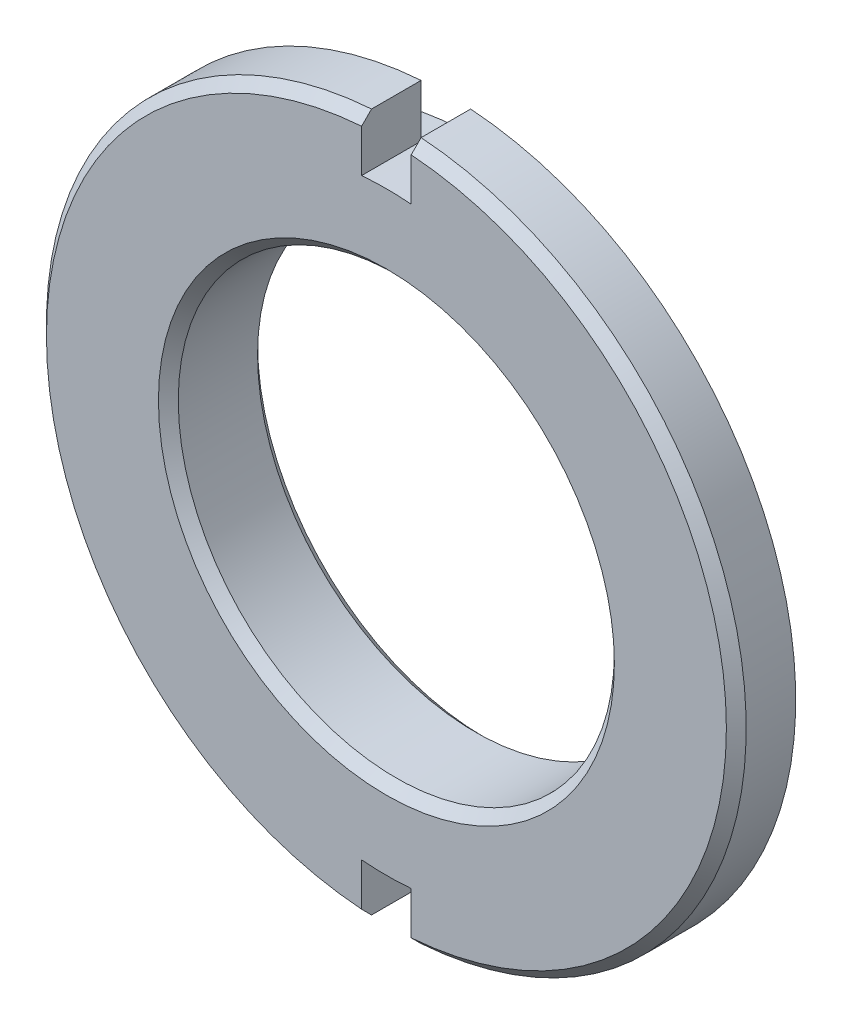
ISO-10303-21;
HEADER;
FILE_DESCRIPTION(('STEP AP214'),'2;1');
FILE_NAME('part.step','',(''),(''),'','','');
FILE_SCHEMA(('AUTOMOTIVE_DESIGN { 1 0 10303 214 1 1 1 1 }'));
ENDSEC;
DATA;
#1=APPLICATION_CONTEXT('core data for automotive mechanical design processes');
#2=APPLICATION_PROTOCOL_DEFINITION('international standard','automotive_design',2000,#1);
#3=PRODUCT_CONTEXT('',#1,'mechanical');
#4=PRODUCT('Part','Part','',(#3));
#5=PRODUCT_RELATED_PRODUCT_CATEGORY('part','',(#4));
#6=PRODUCT_DEFINITION_FORMATION('','',#4);
#7=PRODUCT_DEFINITION_CONTEXT('part definition',#1,'design');
#8=PRODUCT_DEFINITION('design','',#6,#7);
#9=PRODUCT_DEFINITION_SHAPE('','',#8);
#10=(LENGTH_UNIT() NAMED_UNIT(*) SI_UNIT(.MILLI.,.METRE.));
#11=(NAMED_UNIT(*) PLANE_ANGLE_UNIT() SI_UNIT($,.RADIAN.));
#12=(NAMED_UNIT(*) SI_UNIT($,.STERADIAN.) SOLID_ANGLE_UNIT());
#13=UNCERTAINTY_MEASURE_WITH_UNIT(LENGTH_MEASURE(1.E-05),#10,'distance_accuracy_value','');
#14=(GEOMETRIC_REPRESENTATION_CONTEXT(3) GLOBAL_UNCERTAINTY_ASSIGNED_CONTEXT((#13)) GLOBAL_UNIT_ASSIGNED_CONTEXT((#10,
#11,#12)) REPRESENTATION_CONTEXT('',''));
#15=CARTESIAN_POINT('',(0.,0.,0.));
#16=DIRECTION('',(0.,0.,1.));
#17=DIRECTION('',(1.,0.,0.));
#18=AXIS2_PLACEMENT_3D('',#15,#16,#17);
#19=CARTESIAN_POINT('',(0.,0.,0.));
#20=DIRECTION('',(0.,0.,1.));
#21=DIRECTION('',(-1.,0.,0.));
#22=AXIS2_PLACEMENT_3D('',#19,#20,#21);
#23=CONICAL_SURFACE('',#22,11.5,0.785398163397447);
#24=CARTESIAN_POINT('',(0.,0.,-0.5));
#25=DIRECTION('',(0.,0.,-1.));
#26=DIRECTION('',(1.,0.,0.));
#27=AXIS2_PLACEMENT_3D('',#24,#25,#26);
#28=CIRCLE('',#27,11.);
#29=CARTESIAN_POINT('',(11.,0.,-0.5));
#30=VERTEX_POINT('',#29);
#31=EDGE_CURVE('E154',#30,#30,#28,.T.);
#32=ORIENTED_EDGE('',*,*,#31,.T.);
#33=DIRECTION('',(0.707106781186546,0.,0.707106781186549));
#34=VECTOR('',#33,1.);
#35=CARTESIAN_POINT('',(11.5,0.,0.));
#36=LINE('',#35,#34);
#37=CARTESIAN_POINT('',(11.5,0.,0.));
#38=VERTEX_POINT('',#37);
#39=EDGE_CURVE('E11',#30,#38,#36,.T.);
#40=ORIENTED_EDGE('',*,*,#39,.T.);
#41=CARTESIAN_POINT('',(0.,0.,0.));
#42=DIRECTION('',(0.,0.,1.));
#43=DIRECTION('',(1.,0.,0.));
#44=AXIS2_PLACEMENT_3D('',#41,#42,#43);
#45=CIRCLE('',#44,11.5);
#46=EDGE_CURVE('E156',#38,#38,#45,.T.);
#47=ORIENTED_EDGE('',*,*,#46,.T.);
#48=ORIENTED_EDGE('',*,*,#39,.F.);
#49=EDGE_LOOP('',(#32,#40,#47,#48));
#50=FACE_BOUND('',#49,.T.);
#51=ADVANCED_FACE('F16',(#50),#23,.F.);
#52=CARTESIAN_POINT('',(0.,0.,-0.5));
#53=DIRECTION('',(0.,0.,-1.));
#54=DIRECTION('',(-1.,0.,0.));
#55=AXIS2_PLACEMENT_3D('',#52,#53,#54);
#56=CONICAL_SURFACE('',#55,17.65,0.785398163397448);
#57=CARTESIAN_POINT('',(-1.25,17.1043854025802,0.));
#58=CARTESIAN_POINT('',(-1.25,17.3514318912049,-0.246389408384427));
#59=CARTESIAN_POINT('',(-1.25,17.6056809013458,-0.500000000000395));
#60=(BOUNDED_CURVE() B_SPLINE_CURVE(2,(#57,#58,#59),.UNSPECIFIED.,.F.,
.F.) B_SPLINE_CURVE_WITH_KNOTS((3,3),(-0.550361411524432,-0.474870831724073),
.UNSPECIFIED.) CURVE() GEOMETRIC_REPRESENTATION_ITEM() RATIONAL_B_SPLINE_CURVE((1.00316637598992,
1.00370777140882,1.00404107196294)) REPRESENTATION_ITEM(''));
#61=CARTESIAN_POINT('',(-1.25,17.1043854025802,0.));
#62=VERTEX_POINT('',#61);
#63=CARTESIAN_POINT('',(-1.25,17.6056809013455,-0.5));
#64=VERTEX_POINT('',#63);
#65=EDGE_CURVE('E223',#62,#64,#60,.T.);
#66=ORIENTED_EDGE('',*,*,#65,.T.);
#67=CARTESIAN_POINT('',(0.,0.,-0.5));
#68=DIRECTION('',(0.,0.,1.));
#69=DIRECTION('',(1.,0.,0.));
#70=AXIS2_PLACEMENT_3D('',#67,#68,#69);
#71=CIRCLE('',#70,17.65);
#72=CARTESIAN_POINT('',(-1.25,-17.6056809013455,-0.5));
#73=VERTEX_POINT('',#72);
#74=EDGE_CURVE('E208',#64,#73,#71,.T.);
#75=ORIENTED_EDGE('',*,*,#74,.T.);
#76=CARTESIAN_POINT('',(-1.25,-17.6056809013458,-0.500000000000396));
#77=CARTESIAN_POINT('',(-1.25,-17.3514318912049,-0.246389408384428));
#78=CARTESIAN_POINT('',(-1.25,-17.1043854025802,0.));
#79=(BOUNDED_CURVE() B_SPLINE_CURVE(2,(#76,#77,#78),.UNSPECIFIED.,.F.,
.F.) B_SPLINE_CURVE_WITH_KNOTS((3,3),(-0.233047929422891,-0.157557349622532),
.UNSPECIFIED.) CURVE() GEOMETRIC_REPRESENTATION_ITEM() RATIONAL_B_SPLINE_CURVE((1.00404107196294,
1.00370777140882,1.00316637598992)) REPRESENTATION_ITEM(''));
#80=CARTESIAN_POINT('',(-1.25,-17.1043854025802,0.));
#81=VERTEX_POINT('',#80);
#82=EDGE_CURVE('E257',#73,#81,#79,.T.);
#83=ORIENTED_EDGE('',*,*,#82,.T.);
#84=CARTESIAN_POINT('',(0.,0.,0.));
#85=DIRECTION('',(0.,0.,-1.));
#86=DIRECTION('',(1.,0.,0.));
#87=AXIS2_PLACEMENT_3D('',#84,#85,#86);
#88=CIRCLE('',#87,17.15);
#89=EDGE_CURVE('E181',#81,#62,#88,.T.);
#90=ORIENTED_EDGE('',*,*,#89,.T.);
#91=EDGE_LOOP('',(#66,#75,#83,#90));
#92=FACE_BOUND('',#91,.T.);
#93=ADVANCED_FACE('F334',(#92),#56,.T.);
#94=CARTESIAN_POINT('',(0.,0.,-0.5));
#95=DIRECTION('',(0.,0.,-1.));
#96=DIRECTION('',(1.,0.,0.));
#97=AXIS2_PLACEMENT_3D('',#94,#95,#96);
#98=CONICAL_SURFACE('',#97,17.65,0.785398163397448);
#99=CARTESIAN_POINT('',(1.25,-17.1043854025802,0.));
#100=CARTESIAN_POINT('',(1.25,-17.3514318912049,-0.246389408384427));
#101=CARTESIAN_POINT('',(1.25,-17.6056809013458,-0.500000000000395));
#102=(BOUNDED_CURVE() B_SPLINE_CURVE(2,(#99,#100,#101),.UNSPECIFIED.,.F.,
.F.) B_SPLINE_CURVE_WITH_KNOTS((3,3),(-0.550361411524432,-0.474870831724073),
.UNSPECIFIED.) CURVE() GEOMETRIC_REPRESENTATION_ITEM() RATIONAL_B_SPLINE_CURVE((1.00316637598992,
1.00370777140882,1.00404107196294)) REPRESENTATION_ITEM(''));
#103=CARTESIAN_POINT('',(1.25,-17.1043854025802,0.));
#104=VERTEX_POINT('',#103);
#105=CARTESIAN_POINT('',(1.25,-17.6056809013455,-0.5));
#106=VERTEX_POINT('',#105);
#107=EDGE_CURVE('E248',#104,#106,#102,.T.);
#108=ORIENTED_EDGE('',*,*,#107,.T.);
#109=CARTESIAN_POINT('',(0.,0.,-0.5));
#110=DIRECTION('',(0.,0.,1.));
#111=DIRECTION('',(1.,0.,0.));
#112=AXIS2_PLACEMENT_3D('',#109,#110,#111);
#113=CIRCLE('',#112,17.65);
#114=CARTESIAN_POINT('',(1.25,17.6056809013455,-0.5));
#115=VERTEX_POINT('',#114);
#116=EDGE_CURVE('E310',#106,#115,#113,.T.);
#117=ORIENTED_EDGE('',*,*,#116,.T.);
#118=CARTESIAN_POINT('',(1.25,17.6056809013458,-0.500000000000396));
#119=CARTESIAN_POINT('',(1.25,17.3514318912049,-0.246389408384428));
#120=CARTESIAN_POINT('',(1.25,17.1043854025802,0.));
#121=(BOUNDED_CURVE() B_SPLINE_CURVE(2,(#118,#119,#120),.UNSPECIFIED.,.F.,
.F.) B_SPLINE_CURVE_WITH_KNOTS((3,3),(-0.233047929422891,-0.157557349622532),
.UNSPECIFIED.) CURVE() GEOMETRIC_REPRESENTATION_ITEM() RATIONAL_B_SPLINE_CURVE((1.00404107196294,
1.00370777140882,1.00316637598992)) REPRESENTATION_ITEM(''));
#122=CARTESIAN_POINT('',(1.25,17.1043854025802,0.));
#123=VERTEX_POINT('',#122);
#124=EDGE_CURVE('E228',#115,#123,#121,.T.);
#125=ORIENTED_EDGE('',*,*,#124,.T.);
#126=CARTESIAN_POINT('',(0.,0.,0.));
#127=DIRECTION('',(0.,0.,-1.));
#128=DIRECTION('',(1.,0.,0.));
#129=AXIS2_PLACEMENT_3D('',#126,#127,#128);
#130=CIRCLE('',#129,17.15);
#131=EDGE_CURVE('E160',#123,#104,#130,.T.);
#132=ORIENTED_EDGE('',*,*,#131,.T.);
#133=EDGE_LOOP('',(#108,#117,#125,#132));
#134=FACE_BOUND('',#133,.T.);
#135=ADVANCED_FACE('F364',(#134),#98,.T.);
#136=CARTESIAN_POINT('',(0.,0.,-5.));
#137=DIRECTION('',(0.,0.,1.));
#138=DIRECTION('',(-1.,0.,0.));
#139=AXIS2_PLACEMENT_3D('',#136,#137,#138);
#140=CONICAL_SURFACE('',#139,14.5,0.785398163397448);
#141=CARTESIAN_POINT('',(0.,0.,-4.5));
#142=DIRECTION('',(0.,0.,-1.));
#143=DIRECTION('',(1.,0.,0.));
#144=AXIS2_PLACEMENT_3D('',#141,#142,#143);
#145=CIRCLE('',#144,15.);
#146=CARTESIAN_POINT('',(15.,0.,-4.5));
#147=VERTEX_POINT('',#146);
#148=CARTESIAN_POINT('',(-15.,0.,-4.5));
#149=VERTEX_POINT('',#148);
#150=EDGE_CURVE('E216',#147,#149,#145,.T.);
#151=ORIENTED_EDGE('',*,*,#150,.T.);
#152=CARTESIAN_POINT('',(0.,0.,-4.5));
#153=DIRECTION('',(0.,0.,-1.));
#154=DIRECTION('',(1.,0.,0.));
#155=AXIS2_PLACEMENT_3D('',#152,#153,#154);
#156=CIRCLE('',#155,15.);
#157=EDGE_CURVE('E212',#149,#147,#156,.T.);
#158=ORIENTED_EDGE('',*,*,#157,.T.);
#159=DIRECTION('',(-0.707106781186548,0.,-0.707106781186548));
#160=VECTOR('',#159,1.);
#161=CARTESIAN_POINT('',(14.5,0.,-5.));
#162=LINE('',#161,#160);
#163=CARTESIAN_POINT('',(14.5,0.,-5.));
#164=VERTEX_POINT('',#163);
#165=EDGE_CURVE('E27',#147,#164,#162,.T.);
#166=ORIENTED_EDGE('',*,*,#165,.T.);
#167=CARTESIAN_POINT('',(0.,0.,-5.));
#168=DIRECTION('',(0.,0.,1.));
#169=DIRECTION('',(1.,0.,0.));
#170=AXIS2_PLACEMENT_3D('',#167,#168,#169);
#171=CIRCLE('',#170,14.5);
#172=EDGE_CURVE('E296',#164,#164,#171,.T.);
#173=ORIENTED_EDGE('',*,*,#172,.T.);
#174=ORIENTED_EDGE('',*,*,#165,.F.);
#175=EDGE_LOOP('',(#151,#158,#166,#173,#174));
#176=FACE_BOUND('',#175,.T.);
#177=ADVANCED_FACE('F563',(#176),#140,.T.);
#178=CARTESIAN_POINT('',(0.,0.,-4.5));
#179=DIRECTION('',(0.,0.,-1.));
#180=DIRECTION('',(1.,0.,0.));
#181=AXIS2_PLACEMENT_3D('',#178,#179,#180);
#182=CONICAL_SURFACE('',#181,11.,0.785398163397447);
#183=CARTESIAN_POINT('',(0.,0.,-4.5));
#184=DIRECTION('',(0.,0.,1.));
#185=DIRECTION('',(1.,0.,0.));
#186=AXIS2_PLACEMENT_3D('',#183,#184,#185);
#187=CIRCLE('',#186,11.);
#188=CARTESIAN_POINT('',(11.,0.,-4.5));
#189=VERTEX_POINT('',#188);
#190=CARTESIAN_POINT('',(-11.,0.,-4.5));
#191=VERTEX_POINT('',#190);
#192=EDGE_CURVE('E159',#189,#191,#187,.T.);
#193=ORIENTED_EDGE('',*,*,#192,.T.);
#194=DIRECTION('',(-0.707106781186546,0.,-0.707106781186549));
#195=VECTOR('',#194,1.);
#196=CARTESIAN_POINT('',(-11.,0.,-4.5));
#197=LINE('',#196,#195);
#198=CARTESIAN_POINT('',(-11.5,0.,-5.));
#199=VERTEX_POINT('',#198);
#200=EDGE_CURVE('E235',#191,#199,#197,.T.);
#201=ORIENTED_EDGE('',*,*,#200,.T.);
#202=CARTESIAN_POINT('',(0.,0.,-5.));
#203=DIRECTION('',(0.,0.,-1.));
#204=DIRECTION('',(1.,0.,0.));
#205=AXIS2_PLACEMENT_3D('',#202,#203,#204);
#206=CIRCLE('',#205,11.5);
#207=CARTESIAN_POINT('',(11.5,0.,-5.));
#208=VERTEX_POINT('',#207);
#209=EDGE_CURVE('E203',#199,#208,#206,.T.);
#210=ORIENTED_EDGE('',*,*,#209,.T.);
#211=CARTESIAN_POINT('',(0.,0.,-5.));
#212=DIRECTION('',(0.,0.,-1.));
#213=DIRECTION('',(1.,0.,0.));
#214=AXIS2_PLACEMENT_3D('',#211,#212,#213);
#215=CIRCLE('',#214,11.5);
#216=EDGE_CURVE('E222',#208,#199,#215,.T.);
#217=ORIENTED_EDGE('',*,*,#216,.T.);
#218=ORIENTED_EDGE('',*,*,#200,.F.);
#219=CARTESIAN_POINT('',(0.,0.,-4.5));
#220=DIRECTION('',(0.,0.,1.));
#221=DIRECTION('',(1.,0.,0.));
#222=AXIS2_PLACEMENT_3D('',#219,#220,#221);
#223=CIRCLE('',#222,11.);
#224=EDGE_CURVE('E188',#191,#189,#223,.T.);
#225=ORIENTED_EDGE('',*,*,#224,.T.);
#226=EDGE_LOOP('',(#193,#201,#210,#217,#218,#225));
#227=FACE_BOUND('',#226,.T.);
#228=ADVANCED_FACE('F541',(#227),#182,.F.);
#229=CARTESIAN_POINT('',(-1.25,-14.9478259288767,0.00100000000000013));
#230=DIRECTION('',(1.,0.,0.));
#231=DIRECTION('',(0.,1.,0.));
#232=AXIS2_PLACEMENT_3D('',#229,#230,#231);
#233=PLANE('',#232);
#234=DIRECTION('',(0.,0.,-1.));
#235=VECTOR('',#234,1.);
#236=CARTESIAN_POINT('',(-1.25,-17.6056809013455,-0.5));
#237=LINE('',#236,#235);
#238=CARTESIAN_POINT('',(-1.25,-17.6056809013455,-3.));
#239=VERTEX_POINT('',#238);
#240=EDGE_CURVE('E204',#73,#239,#237,.T.);
#241=ORIENTED_EDGE('',*,*,#240,.T.);
#242=DIRECTION('',(0.,-1.,0.));
#243=VECTOR('',#242,1.);
#244=CARTESIAN_POINT('',(-1.25,-14.9478259288767,-3.));
#245=LINE('',#244,#243);
#246=CARTESIAN_POINT('',(-1.25,-14.9478259288767,-3.));
#247=VERTEX_POINT('',#246);
#248=EDGE_CURVE('E191',#247,#239,#245,.T.);
#249=ORIENTED_EDGE('',*,*,#248,.F.);
#250=DIRECTION('',(0.,0.,-1.));
#251=VECTOR('',#250,1.);
#252=CARTESIAN_POINT('',(-1.25,-14.9478259288767,0.));
#253=LINE('',#252,#251);
#254=CARTESIAN_POINT('',(-1.25,-14.9478259288767,0.));
#255=VERTEX_POINT('',#254);
#256=EDGE_CURVE('E229',#255,#247,#253,.T.);
#257=ORIENTED_EDGE('',*,*,#256,.F.);
#258=DIRECTION('',(0.,1.,0.));
#259=VECTOR('',#258,1.);
#260=CARTESIAN_POINT('',(-1.25,-17.1043854025802,0.));
#261=LINE('',#260,#259);
#262=EDGE_CURVE('E176',#81,#255,#261,.T.);
#263=ORIENTED_EDGE('',*,*,#262,.F.);
#264=ORIENTED_EDGE('',*,*,#82,.F.);
#265=EDGE_LOOP('',(#241,#249,#257,#263,#264));
#266=FACE_BOUND('',#265,.T.);
#267=ADVANCED_FACE('F352',(#266),#233,.T.);
#268=CARTESIAN_POINT('',(1.25,-14.9478259288767,0.00100000000000013));
#269=DIRECTION('',(-1.,0.,0.));
#270=DIRECTION('',(0.,0.,1.));
#271=AXIS2_PLACEMENT_3D('',#268,#269,#270);
#272=PLANE('',#271);
#273=DIRECTION('',(0.,-1.,0.));
#274=VECTOR('',#273,1.);
#275=CARTESIAN_POINT('',(1.25,-14.9478259288767,0.));
#276=LINE('',#275,#274);
#277=CARTESIAN_POINT('',(1.25,-14.9478259288767,0.));
#278=VERTEX_POINT('',#277);
#279=EDGE_CURVE('E171',#278,#104,#276,.T.);
#280=ORIENTED_EDGE('',*,*,#279,.F.);
#281=DIRECTION('',(0.,0.,-1.));
#282=VECTOR('',#281,1.);
#283=CARTESIAN_POINT('',(1.25,-14.9478259288767,0.));
#284=LINE('',#283,#282);
#285=CARTESIAN_POINT('',(1.25,-14.9478259288767,-3.));
#286=VERTEX_POINT('',#285);
#287=EDGE_CURVE('E238',#278,#286,#284,.T.);
#288=ORIENTED_EDGE('',*,*,#287,.T.);
#289=DIRECTION('',(0.,1.,0.));
#290=VECTOR('',#289,1.);
#291=CARTESIAN_POINT('',(1.25,-17.6056809013455,-3.));
#292=LINE('',#291,#290);
#293=CARTESIAN_POINT('',(1.25,-17.6056809013455,-3.));
#294=VERTEX_POINT('',#293);
#295=EDGE_CURVE('E197',#294,#286,#292,.T.);
#296=ORIENTED_EDGE('',*,*,#295,.F.);
#297=DIRECTION('',(0.,0.,-1.));
#298=VECTOR('',#297,1.);
#299=CARTESIAN_POINT('',(1.25,-17.6056809013455,-0.5));
#300=LINE('',#299,#298);
#301=EDGE_CURVE('E285',#106,#294,#300,.T.);
#302=ORIENTED_EDGE('',*,*,#301,.F.);
#303=ORIENTED_EDGE('',*,*,#107,.F.);
#304=EDGE_LOOP('',(#280,#288,#296,#302,#303));
#305=FACE_BOUND('',#304,.T.);
#306=ADVANCED_FACE('F360',(#305),#272,.T.);
#307=CARTESIAN_POINT('',(1.25,17.6056809013455,0.00100000000000013));
#308=DIRECTION('',(-1.,0.,0.));
#309=DIRECTION('',(0.,0.,1.));
#310=AXIS2_PLACEMENT_3D('',#307,#308,#309);
#311=PLANE('',#310);
#312=DIRECTION('',(0.,0.,-1.));
#313=VECTOR('',#312,1.);
#314=CARTESIAN_POINT('',(1.25,17.6056809013455,-0.5));
#315=LINE('',#314,#313);
#316=CARTESIAN_POINT('',(1.25,17.6056809013455,-3.));
#317=VERTEX_POINT('',#316);
#318=EDGE_CURVE('E284',#115,#317,#315,.T.);
#319=ORIENTED_EDGE('',*,*,#318,.T.);
#320=DIRECTION('',(0.,1.,0.));
#321=VECTOR('',#320,1.);
#322=CARTESIAN_POINT('',(1.25,14.9478259288767,-3.));
#323=LINE('',#322,#321);
#324=CARTESIAN_POINT('',(1.25,14.9478259288767,-3.));
#325=VERTEX_POINT('',#324);
#326=EDGE_CURVE('E196',#325,#317,#323,.T.);
#327=ORIENTED_EDGE('',*,*,#326,.F.);
#328=DIRECTION('',(0.,0.,-1.));
#329=VECTOR('',#328,1.);
#330=CARTESIAN_POINT('',(1.25,14.9478259288767,0.));
#331=LINE('',#330,#329);
#332=CARTESIAN_POINT('',(1.25,14.9478259288767,0.));
#333=VERTEX_POINT('',#332);
#334=EDGE_CURVE('E241',#333,#325,#331,.T.);
#335=ORIENTED_EDGE('',*,*,#334,.F.);
#336=DIRECTION('',(0.,-1.,0.));
#337=VECTOR('',#336,1.);
#338=CARTESIAN_POINT('',(1.25,17.1043854025802,0.));
#339=LINE('',#338,#337);
#340=EDGE_CURVE('E175',#123,#333,#339,.T.);
#341=ORIENTED_EDGE('',*,*,#340,.F.);
#342=ORIENTED_EDGE('',*,*,#124,.F.);
#343=EDGE_LOOP('',(#319,#327,#335,#341,#342));
#344=FACE_BOUND('',#343,.T.);
#345=ADVANCED_FACE('F368',(#344),#311,.T.);
#346=CARTESIAN_POINT('',(-1.25,17.6056809013455,0.00100000000000013));
#347=DIRECTION('',(1.,0.,0.));
#348=DIRECTION('',(0.,1.,0.));
#349=AXIS2_PLACEMENT_3D('',#346,#347,#348);
#350=PLANE('',#349);
#351=DIRECTION('',(0.,1.,0.));
#352=VECTOR('',#351,1.);
#353=CARTESIAN_POINT('',(-1.25,14.9478259288767,0.));
#354=LINE('',#353,#352);
#355=CARTESIAN_POINT('',(-1.25,14.9478259288767,0.));
#356=VERTEX_POINT('',#355);
#357=EDGE_CURVE('E269',#356,#62,#354,.T.);
#358=ORIENTED_EDGE('',*,*,#357,.F.);
#359=DIRECTION('',(0.,0.,-1.));
#360=VECTOR('',#359,1.);
#361=CARTESIAN_POINT('',(-1.25,14.9478259288767,0.));
#362=LINE('',#361,#360);
#363=CARTESIAN_POINT('',(-1.25,14.9478259288767,-3.));
#364=VERTEX_POINT('',#363);
#365=EDGE_CURVE('E20',#356,#364,#362,.T.);
#366=ORIENTED_EDGE('',*,*,#365,.T.);
#367=DIRECTION('',(0.,-1.,0.));
#368=VECTOR('',#367,1.);
#369=CARTESIAN_POINT('',(-1.25,17.6056809013455,-3.));
#370=LINE('',#369,#368);
#371=CARTESIAN_POINT('',(-1.25,17.6056809013455,-3.));
#372=VERTEX_POINT('',#371);
#373=EDGE_CURVE('E187',#372,#364,#370,.T.);
#374=ORIENTED_EDGE('',*,*,#373,.F.);
#375=DIRECTION('',(0.,0.,-1.));
#376=VECTOR('',#375,1.);
#377=CARTESIAN_POINT('',(-1.25,17.6056809013455,-0.5));
#378=LINE('',#377,#376);
#379=EDGE_CURVE('E198',#64,#372,#378,.T.);
#380=ORIENTED_EDGE('',*,*,#379,.F.);
#381=ORIENTED_EDGE('',*,*,#65,.F.);
#382=EDGE_LOOP('',(#358,#366,#374,#380,#381));
#383=FACE_BOUND('',#382,.T.);
#384=ADVANCED_FACE('F343',(#383),#350,.T.);
#385=CARTESIAN_POINT('',(0.,0.,-3.));
#386=DIRECTION('',(0.,0.,1.));
#387=DIRECTION('',(1.,0.,0.));
#388=AXIS2_PLACEMENT_3D('',#385,#386,#387);
#389=CYLINDRICAL_SURFACE('',#388,15.);
#390=ORIENTED_EDGE('',*,*,#150,.F.);
#391=ORIENTED_EDGE('',*,*,#157,.F.);
#392=DIRECTION('',(0.,0.,1.));
#393=VECTOR('',#392,1.);
#394=CARTESIAN_POINT('',(-15.,0.,-3.));
#395=LINE('',#394,#393);
#396=CARTESIAN_POINT('',(-15.,0.,-3.));
#397=VERTEX_POINT('',#396);
#398=EDGE_CURVE('E41',#149,#397,#395,.T.);
#399=ORIENTED_EDGE('',*,*,#398,.T.);
#400=CARTESIAN_POINT('',(0.,0.,-3.));
#401=DIRECTION('',(0.,0.,1.));
#402=DIRECTION('',(1.,0.,0.));
#403=AXIS2_PLACEMENT_3D('',#400,#401,#402);
#404=CIRCLE('',#403,15.);
#405=EDGE_CURVE('E182',#364,#397,#404,.T.);
#406=ORIENTED_EDGE('',*,*,#405,.F.);
#407=ORIENTED_EDGE('',*,*,#365,.F.);
#408=CARTESIAN_POINT('',(0.,0.,0.));
#409=DIRECTION('',(0.,0.,1.));
#410=DIRECTION('',(1.,0.,0.));
#411=AXIS2_PLACEMENT_3D('',#408,#409,#410);
#412=CIRCLE('',#411,15.);
#413=EDGE_CURVE('E262',#333,#356,#412,.T.);
#414=ORIENTED_EDGE('',*,*,#413,.F.);
#415=ORIENTED_EDGE('',*,*,#334,.T.);
#416=CARTESIAN_POINT('',(0.,0.,-3.));
#417=DIRECTION('',(0.,0.,1.));
#418=DIRECTION('',(1.,0.,0.));
#419=AXIS2_PLACEMENT_3D('',#416,#417,#418);
#420=CIRCLE('',#419,15.);
#421=EDGE_CURVE('E192',#286,#325,#420,.T.);
#422=ORIENTED_EDGE('',*,*,#421,.F.);
#423=ORIENTED_EDGE('',*,*,#287,.F.);
#424=CARTESIAN_POINT('',(0.,0.,0.));
#425=DIRECTION('',(0.,0.,1.));
#426=DIRECTION('',(1.,0.,0.));
#427=AXIS2_PLACEMENT_3D('',#424,#425,#426);
#428=CIRCLE('',#427,15.);
#429=EDGE_CURVE('E180',#255,#278,#428,.T.);
#430=ORIENTED_EDGE('',*,*,#429,.F.);
#431=ORIENTED_EDGE('',*,*,#256,.T.);
#432=CARTESIAN_POINT('',(0.,0.,-3.));
#433=DIRECTION('',(0.,0.,1.));
#434=DIRECTION('',(1.,0.,0.));
#435=AXIS2_PLACEMENT_3D('',#432,#433,#434);
#436=CIRCLE('',#435,15.);
#437=EDGE_CURVE('E186',#397,#247,#436,.T.);
#438=ORIENTED_EDGE('',*,*,#437,.F.);
#439=ORIENTED_EDGE('',*,*,#398,.F.);
#440=EDGE_LOOP('',(#390,#391,#399,#406,#407,#414,#415,#422,#423,#430,#431,#438,#439));
#441=FACE_BOUND('',#440,.T.);
#442=ADVANCED_FACE('F356',(#441),#389,.T.);
#443=CARTESIAN_POINT('',(0.,0.,-3.));
#444=DIRECTION('',(0.,0.,1.));
#445=DIRECTION('',(1.,0.,0.));
#446=AXIS2_PLACEMENT_3D('',#443,#444,#445);
#447=PLANE('',#446);
#448=ORIENTED_EDGE('',*,*,#248,.T.);
#449=CARTESIAN_POINT('',(0.,0.,-3.));
#450=DIRECTION('',(0.,0.,1.));
#451=DIRECTION('',(1.,0.,0.));
#452=AXIS2_PLACEMENT_3D('',#449,#450,#451);
#453=CIRCLE('',#452,17.65);
#454=EDGE_CURVE('E202',#372,#239,#453,.T.);
#455=ORIENTED_EDGE('',*,*,#454,.F.);
#456=ORIENTED_EDGE('',*,*,#373,.T.);
#457=ORIENTED_EDGE('',*,*,#405,.T.);
#458=ORIENTED_EDGE('',*,*,#437,.T.);
#459=EDGE_LOOP('',(#448,#455,#456,#457,#458));
#460=FACE_BOUND('',#459,.T.);
#461=ADVANCED_FACE('F524',(#460),#447,.F.);
#462=CARTESIAN_POINT('',(0.,0.,-5.));
#463=DIRECTION('',(0.,0.,-1.));
#464=DIRECTION('',(-1.,0.,0.));
#465=AXIS2_PLACEMENT_3D('',#462,#463,#464);
#466=CYLINDRICAL_SURFACE('',#465,11.);
#467=ORIENTED_EDGE('',*,*,#192,.F.);
#468=DIRECTION('',(0.,0.,1.));
#469=VECTOR('',#468,1.);
#470=CARTESIAN_POINT('',(11.,0.,-5.));
#471=LINE('',#470,#469);
#472=EDGE_CURVE('E168',#189,#30,#471,.T.);
#473=ORIENTED_EDGE('',*,*,#472,.T.);
#474=ORIENTED_EDGE('',*,*,#31,.F.);
#475=ORIENTED_EDGE('',*,*,#472,.F.);
#476=ORIENTED_EDGE('',*,*,#224,.F.);
#477=EDGE_LOOP('',(#467,#473,#474,#475,#476));
#478=FACE_BOUND('',#477,.T.);
#479=ADVANCED_FACE('F520',(#478),#466,.F.);
#480=CARTESIAN_POINT('',(0.,0.,0.));
#481=DIRECTION('',(0.,0.,1.));
#482=DIRECTION('',(1.,0.,0.));
#483=AXIS2_PLACEMENT_3D('',#480,#481,#482);
#484=PLANE('',#483);
#485=ORIENTED_EDGE('',*,*,#46,.F.);
#486=EDGE_LOOP('',(#485));
#487=FACE_BOUND('',#486,.T.);
#488=ORIENTED_EDGE('',*,*,#340,.T.);
#489=ORIENTED_EDGE('',*,*,#413,.T.);
#490=ORIENTED_EDGE('',*,*,#357,.T.);
#491=ORIENTED_EDGE('',*,*,#89,.F.);
#492=ORIENTED_EDGE('',*,*,#262,.T.);
#493=ORIENTED_EDGE('',*,*,#429,.T.);
#494=ORIENTED_EDGE('',*,*,#279,.T.);
#495=ORIENTED_EDGE('',*,*,#131,.F.);
#496=EDGE_LOOP('',(#488,#489,#490,#491,#492,#493,#494,#495));
#497=FACE_BOUND('',#496,.T.);
#498=ADVANCED_FACE('F340',(#487,#497),#484,.T.);
#499=CARTESIAN_POINT('',(0.,0.,-5.));
#500=DIRECTION('',(0.,0.,-1.));
#501=DIRECTION('',(-1.,0.,0.));
#502=AXIS2_PLACEMENT_3D('',#499,#500,#501);
#503=CYLINDRICAL_SURFACE('',#502,17.65);
#504=ORIENTED_EDGE('',*,*,#379,.T.);
#505=ORIENTED_EDGE('',*,*,#454,.T.);
#506=ORIENTED_EDGE('',*,*,#240,.F.);
#507=ORIENTED_EDGE('',*,*,#74,.F.);
#508=EDGE_LOOP('',(#504,#505,#506,#507));
#509=FACE_BOUND('',#508,.T.);
#510=ADVANCED_FACE('F348',(#509),#503,.T.);
#511=CARTESIAN_POINT('',(0.,0.,-5.));
#512=DIRECTION('',(0.,0.,1.));
#513=DIRECTION('',(1.,0.,0.));
#514=AXIS2_PLACEMENT_3D('',#511,#512,#513);
#515=PLANE('',#514);
#516=ORIENTED_EDGE('',*,*,#216,.F.);
#517=ORIENTED_EDGE('',*,*,#209,.F.);
#518=EDGE_LOOP('',(#516,#517));
#519=FACE_BOUND('',#518,.T.);
#520=ORIENTED_EDGE('',*,*,#172,.F.);
#521=EDGE_LOOP('',(#520));
#522=FACE_BOUND('',#521,.T.);
#523=ADVANCED_FACE('F18',(#519,#522),#515,.F.);
#524=CARTESIAN_POINT('',(0.,0.,-3.));
#525=DIRECTION('',(0.,0.,1.));
#526=DIRECTION('',(1.,0.,0.));
#527=AXIS2_PLACEMENT_3D('',#524,#525,#526);
#528=PLANE('',#527);
#529=ORIENTED_EDGE('',*,*,#295,.T.);
#530=ORIENTED_EDGE('',*,*,#421,.T.);
#531=ORIENTED_EDGE('',*,*,#326,.T.);
#532=CARTESIAN_POINT('',(0.,0.,-3.));
#533=DIRECTION('',(0.,0.,1.));
#534=DIRECTION('',(1.,0.,0.));
#535=AXIS2_PLACEMENT_3D('',#532,#533,#534);
#536=CIRCLE('',#535,17.65);
#537=EDGE_CURVE('E277',#294,#317,#536,.T.);
#538=ORIENTED_EDGE('',*,*,#537,.F.);
#539=EDGE_LOOP('',(#529,#530,#531,#538));
#540=FACE_BOUND('',#539,.T.);
#541=ADVANCED_FACE('F534',(#540),#528,.F.);
#542=CARTESIAN_POINT('',(0.,0.,-5.));
#543=DIRECTION('',(0.,0.,-1.));
#544=DIRECTION('',(1.,0.,0.));
#545=AXIS2_PLACEMENT_3D('',#542,#543,#544);
#546=CYLINDRICAL_SURFACE('',#545,17.65);
#547=ORIENTED_EDGE('',*,*,#301,.T.);
#548=ORIENTED_EDGE('',*,*,#537,.T.);
#549=ORIENTED_EDGE('',*,*,#318,.F.);
#550=ORIENTED_EDGE('',*,*,#116,.F.);
#551=EDGE_LOOP('',(#547,#548,#549,#550));
#552=FACE_BOUND('',#551,.T.);
#553=ADVANCED_FACE('F443',(#552),#546,.T.);
#554=CLOSED_SHELL('',(#51,#93,#135,#177,#228,#267,#306,#345,#384,#442,#461,#479,#498,#510,#523,
#541,#553));
#555=MANIFOLD_SOLID_BREP('B1',#554);
#556=ADVANCED_BREP_SHAPE_REPRESENTATION('',(#18,#555),#14);
#557=SHAPE_DEFINITION_REPRESENTATION(#9,#556);
ENDSEC;
END-ISO-10303-21;
